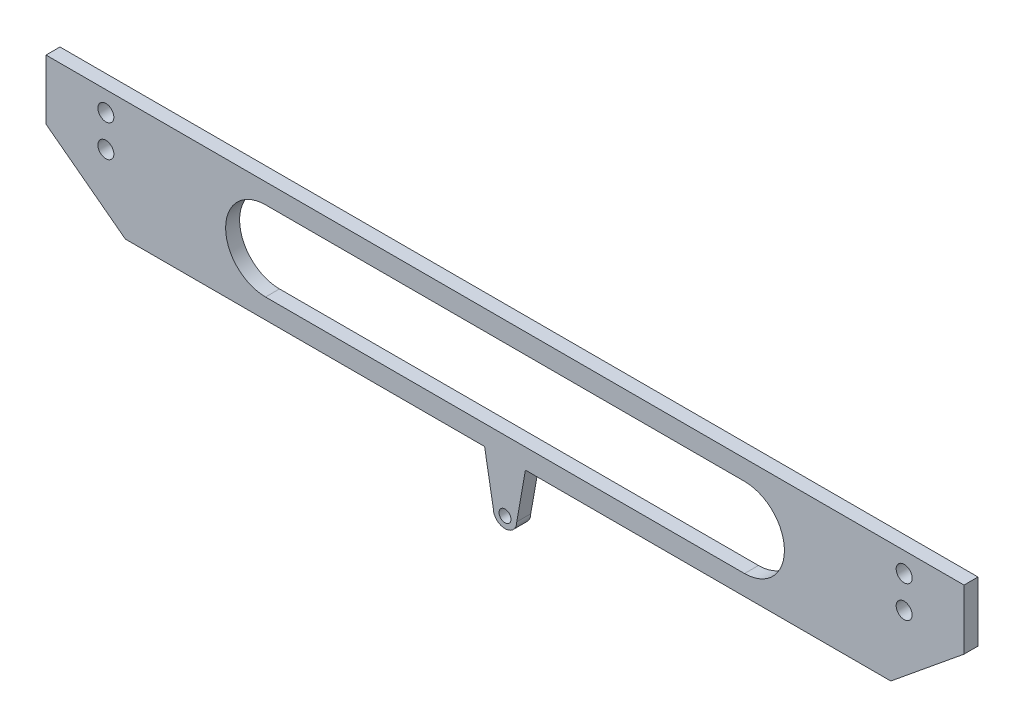
ISO-10303-21;
HEADER;
FILE_DESCRIPTION(('STEP AP214'),'2;1');
FILE_NAME('part.step','',(''),(''),'','','');
FILE_SCHEMA(('AUTOMOTIVE_DESIGN { 1 0 10303 214 1 1 1 1 }'));
ENDSEC;
DATA;
#1=APPLICATION_CONTEXT('core data for automotive mechanical design processes');
#2=APPLICATION_PROTOCOL_DEFINITION('international standard','automotive_design',2000,#1);
#3=PRODUCT_CONTEXT('',#1,'mechanical');
#4=PRODUCT('Part','Part','',(#3));
#5=PRODUCT_RELATED_PRODUCT_CATEGORY('part','',(#4));
#6=PRODUCT_DEFINITION_FORMATION('','',#4);
#7=PRODUCT_DEFINITION_CONTEXT('part definition',#1,'design');
#8=PRODUCT_DEFINITION('design','',#6,#7);
#9=PRODUCT_DEFINITION_SHAPE('','',#8);
#10=(LENGTH_UNIT() NAMED_UNIT(*) SI_UNIT(.MILLI.,.METRE.));
#11=(NAMED_UNIT(*) PLANE_ANGLE_UNIT() SI_UNIT($,.RADIAN.));
#12=(NAMED_UNIT(*) SI_UNIT($,.STERADIAN.) SOLID_ANGLE_UNIT());
#13=UNCERTAINTY_MEASURE_WITH_UNIT(LENGTH_MEASURE(1.E-05),#10,'distance_accuracy_value','');
#14=(GEOMETRIC_REPRESENTATION_CONTEXT(3) GLOBAL_UNCERTAINTY_ASSIGNED_CONTEXT((#13)) GLOBAL_UNIT_ASSIGNED_CONTEXT((#10,
#11,#12)) REPRESENTATION_CONTEXT('',''));
#15=CARTESIAN_POINT('',(0.,0.,0.));
#16=DIRECTION('',(0.,0.,1.));
#17=DIRECTION('',(1.,0.,0.));
#18=AXIS2_PLACEMENT_3D('',#15,#16,#17);
#19=CARTESIAN_POINT('',(-30.1159237685014,77.5000000000003,-3.5));
#20=DIRECTION('',(0.,-1.,0.));
#21=DIRECTION('',(0.,0.,-1.));
#22=AXIS2_PLACEMENT_3D('',#19,#20,#21);
#23=PLANE('',#22);
#24=DIRECTION('',(1.,0.,0.));
#25=VECTOR('',#24,1.);
#26=CARTESIAN_POINT('',(-30.1159237685014,77.5000000000003,0.));
#27=LINE('',#26,#25);
#28=CARTESIAN_POINT('',(-30.1159237685014,77.5000000000003,0.));
#29=VERTEX_POINT('',#28);
#30=CARTESIAN_POINT('',(59.8840762314986,77.5000000000003,0.));
#31=VERTEX_POINT('',#30);
#32=EDGE_CURVE('E178',#29,#31,#27,.T.);
#33=ORIENTED_EDGE('',*,*,#32,.F.);
#34=DIRECTION('',(0.,0.,1.));
#35=VECTOR('',#34,1.);
#36=CARTESIAN_POINT('',(-30.1159237685014,77.5000000000003,-3.5));
#37=LINE('',#36,#35);
#38=CARTESIAN_POINT('',(-30.1159237685014,77.5000000000003,-3.5));
#39=VERTEX_POINT('',#38);
#40=EDGE_CURVE('E11',#39,#29,#37,.T.);
#41=ORIENTED_EDGE('',*,*,#40,.F.);
#42=DIRECTION('',(1.,0.,0.));
#43=VECTOR('',#42,1.);
#44=CARTESIAN_POINT('',(-30.1159237685014,77.5000000000003,-3.5));
#45=LINE('',#44,#43);
#46=CARTESIAN_POINT('',(59.8840762314986,77.5000000000003,-3.5));
#47=VERTEX_POINT('',#46);
#48=EDGE_CURVE('E181',#39,#47,#45,.T.);
#49=ORIENTED_EDGE('',*,*,#48,.T.);
#50=DIRECTION('',(0.,0.,1.));
#51=VECTOR('',#50,1.);
#52=CARTESIAN_POINT('',(59.8840762314986,77.5000000000003,-3.5));
#53=LINE('',#52,#51);
#54=EDGE_CURVE('E37',#47,#31,#53,.T.);
#55=ORIENTED_EDGE('',*,*,#54,.T.);
#56=EDGE_LOOP('',(#33,#41,#49,#55));
#57=FACE_BOUND('',#56,.T.);
#58=ADVANCED_FACE('F34',(#57),#23,.T.);
#59=CARTESIAN_POINT('',(-30.1159237685014,77.5000000000003,-3.5));
#60=DIRECTION('',(-0.602231675437866,-0.798321369561971,0.));
#61=DIRECTION('',(0.798321369561971,-0.602231675437866,0.));
#62=AXIS2_PLACEMENT_3D('',#59,#60,#61);
#63=PLANE('',#62);
#64=DIRECTION('',(0.798321369561971,-0.602231675437866,0.));
#65=VECTOR('',#64,1.);
#66=CARTESIAN_POINT('',(-30.1159237685014,77.5000000000003,0.));
#67=LINE('',#66,#65);
#68=CARTESIAN_POINT('',(-49.9999999999999,92.5000000000003,0.));
#69=VERTEX_POINT('',#68);
#70=EDGE_CURVE('E185',#69,#29,#67,.T.);
#71=ORIENTED_EDGE('',*,*,#70,.F.);
#72=DIRECTION('',(0.,0.,1.));
#73=VECTOR('',#72,1.);
#74=CARTESIAN_POINT('',(-49.9999999999999,92.5000000000003,-3.5));
#75=LINE('',#74,#73);
#76=CARTESIAN_POINT('',(-49.9999999999999,92.5000000000003,-3.5));
#77=VERTEX_POINT('',#76);
#78=EDGE_CURVE('E42',#77,#69,#75,.T.);
#79=ORIENTED_EDGE('',*,*,#78,.F.);
#80=DIRECTION('',(0.798321369561971,-0.602231675437866,0.));
#81=VECTOR('',#80,1.);
#82=CARTESIAN_POINT('',(-30.1159237685014,77.5000000000003,-3.5));
#83=LINE('',#82,#81);
#84=EDGE_CURVE('E209',#77,#39,#83,.T.);
#85=ORIENTED_EDGE('',*,*,#84,.T.);
#86=ORIENTED_EDGE('',*,*,#40,.T.);
#87=EDGE_LOOP('',(#71,#79,#85,#86));
#88=FACE_BOUND('',#87,.T.);
#89=ADVANCED_FACE('F266',(#88),#63,.T.);
#90=CARTESIAN_POINT('',(-49.9999999999999,92.5000000000003,-3.5));
#91=DIRECTION('',(-1.,0.,0.));
#92=DIRECTION('',(0.,0.,1.));
#93=AXIS2_PLACEMENT_3D('',#90,#91,#92);
#94=PLANE('',#93);
#95=DIRECTION('',(0.,-1.,0.));
#96=VECTOR('',#95,1.);
#97=CARTESIAN_POINT('',(-49.9999999999999,92.5000000000003,0.));
#98=LINE('',#97,#96);
#99=CARTESIAN_POINT('',(-49.9999999999999,107.5,0.));
#100=VERTEX_POINT('',#99);
#101=EDGE_CURVE('E235',#100,#69,#98,.T.);
#102=ORIENTED_EDGE('',*,*,#101,.F.);
#103=DIRECTION('',(0.,0.,1.));
#104=VECTOR('',#103,1.);
#105=CARTESIAN_POINT('',(-49.9999999999999,107.5,-3.5));
#106=LINE('',#105,#104);
#107=CARTESIAN_POINT('',(-49.9999999999999,107.5,-3.5));
#108=VERTEX_POINT('',#107);
#109=EDGE_CURVE('E241',#108,#100,#106,.T.);
#110=ORIENTED_EDGE('',*,*,#109,.F.);
#111=DIRECTION('',(0.,-1.,0.));
#112=VECTOR('',#111,1.);
#113=CARTESIAN_POINT('',(-49.9999999999999,92.5000000000003,-3.5));
#114=LINE('',#113,#112);
#115=EDGE_CURVE('E206',#108,#77,#114,.T.);
#116=ORIENTED_EDGE('',*,*,#115,.T.);
#117=ORIENTED_EDGE('',*,*,#78,.T.);
#118=EDGE_LOOP('',(#102,#110,#116,#117));
#119=FACE_BOUND('',#118,.T.);
#120=ADVANCED_FACE('F294',(#119),#94,.T.);
#121=CARTESIAN_POINT('',(-49.9999999999999,107.5,-3.5));
#122=DIRECTION('',(0.,1.,0.));
#123=DIRECTION('',(0.,0.,1.));
#124=AXIS2_PLACEMENT_3D('',#121,#122,#123);
#125=PLANE('',#124);
#126=DIRECTION('',(-1.,0.,0.));
#127=VECTOR('',#126,1.);
#128=CARTESIAN_POINT('',(-49.9999999999999,107.5,0.));
#129=LINE('',#128,#127);
#130=CARTESIAN_POINT('',(180.,107.5,0.));
#131=VERTEX_POINT('',#130);
#132=EDGE_CURVE('E232',#131,#100,#129,.T.);
#133=ORIENTED_EDGE('',*,*,#132,.F.);
#134=DIRECTION('',(0.,0.,1.));
#135=VECTOR('',#134,1.);
#136=CARTESIAN_POINT('',(180.,107.5,-3.5));
#137=LINE('',#136,#135);
#138=CARTESIAN_POINT('',(180.,107.5,-3.5));
#139=VERTEX_POINT('',#138);
#140=EDGE_CURVE('E243',#139,#131,#137,.T.);
#141=ORIENTED_EDGE('',*,*,#140,.F.);
#142=DIRECTION('',(-1.,0.,0.));
#143=VECTOR('',#142,1.);
#144=CARTESIAN_POINT('',(-49.9999999999999,107.5,-3.5));
#145=LINE('',#144,#143);
#146=EDGE_CURVE('E203',#139,#108,#145,.T.);
#147=ORIENTED_EDGE('',*,*,#146,.T.);
#148=ORIENTED_EDGE('',*,*,#109,.T.);
#149=EDGE_LOOP('',(#133,#141,#147,#148));
#150=FACE_BOUND('',#149,.T.);
#151=ADVANCED_FACE('F292',(#150),#125,.T.);
#152=CARTESIAN_POINT('',(180.,92.5000000000003,-3.5));
#153=DIRECTION('',(1.,0.,0.));
#154=DIRECTION('',(0.,0.,-1.));
#155=AXIS2_PLACEMENT_3D('',#152,#153,#154);
#156=PLANE('',#155);
#157=DIRECTION('',(0.,1.,0.));
#158=VECTOR('',#157,1.);
#159=CARTESIAN_POINT('',(180.,92.5000000000003,0.));
#160=LINE('',#159,#158);
#161=CARTESIAN_POINT('',(180.,92.5000000000003,0.));
#162=VERTEX_POINT('',#161);
#163=EDGE_CURVE('E229',#162,#131,#160,.T.);
#164=ORIENTED_EDGE('',*,*,#163,.F.);
#165=DIRECTION('',(0.,0.,1.));
#166=VECTOR('',#165,1.);
#167=CARTESIAN_POINT('',(180.,92.5000000000003,-3.5));
#168=LINE('',#167,#166);
#169=CARTESIAN_POINT('',(180.,92.5000000000003,-3.5));
#170=VERTEX_POINT('',#169);
#171=EDGE_CURVE('E245',#170,#162,#168,.T.);
#172=ORIENTED_EDGE('',*,*,#171,.F.);
#173=DIRECTION('',(0.,1.,0.));
#174=VECTOR('',#173,1.);
#175=CARTESIAN_POINT('',(180.,92.5000000000003,-3.5));
#176=LINE('',#175,#174);
#177=EDGE_CURVE('E200',#170,#139,#176,.T.);
#178=ORIENTED_EDGE('',*,*,#177,.T.);
#179=ORIENTED_EDGE('',*,*,#140,.T.);
#180=EDGE_LOOP('',(#164,#172,#178,#179));
#181=FACE_BOUND('',#180,.T.);
#182=ADVANCED_FACE('F288',(#181),#156,.T.);
#183=CARTESIAN_POINT('',(161.654067638135,77.5000000000003,-3.5));
#184=DIRECTION('',(0.632977188407132,-0.774170445674725,0.));
#185=DIRECTION('',(0.774170445674725,0.632977188407132,0.));
#186=AXIS2_PLACEMENT_3D('',#183,#184,#185);
#187=PLANE('',#186);
#188=DIRECTION('',(0.774170445674725,0.632977188407132,0.));
#189=VECTOR('',#188,1.);
#190=CARTESIAN_POINT('',(161.654067638135,77.5000000000003,0.));
#191=LINE('',#190,#189);
#192=CARTESIAN_POINT('',(161.654067638135,77.5000000000003,0.));
#193=VERTEX_POINT('',#192);
#194=EDGE_CURVE('E226',#193,#162,#191,.T.);
#195=ORIENTED_EDGE('',*,*,#194,.F.);
#196=DIRECTION('',(0.,0.,1.));
#197=VECTOR('',#196,1.);
#198=CARTESIAN_POINT('',(161.654067638135,77.5000000000003,-3.5));
#199=LINE('',#198,#197);
#200=CARTESIAN_POINT('',(161.654067638135,77.5000000000003,-3.5));
#201=VERTEX_POINT('',#200);
#202=EDGE_CURVE('E247',#201,#193,#199,.T.);
#203=ORIENTED_EDGE('',*,*,#202,.F.);
#204=DIRECTION('',(0.774170445674725,0.632977188407132,0.));
#205=VECTOR('',#204,1.);
#206=CARTESIAN_POINT('',(161.654067638135,77.5000000000003,-3.5));
#207=LINE('',#206,#205);
#208=EDGE_CURVE('E197',#201,#170,#207,.T.);
#209=ORIENTED_EDGE('',*,*,#208,.T.);
#210=ORIENTED_EDGE('',*,*,#171,.T.);
#211=EDGE_LOOP('',(#195,#203,#209,#210));
#212=FACE_BOUND('',#211,.T.);
#213=ADVANCED_FACE('F284',(#212),#187,.T.);
#214=CARTESIAN_POINT('',(161.654067638135,77.5000000000003,-3.5));
#215=DIRECTION('',(0.,-1.,0.));
#216=DIRECTION('',(1.,0.,0.));
#217=AXIS2_PLACEMENT_3D('',#214,#215,#216);
#218=PLANE('',#217);
#219=DIRECTION('',(1.,0.,0.));
#220=VECTOR('',#219,1.);
#221=CARTESIAN_POINT('',(161.654067638135,77.5000000000003,0.));
#222=LINE('',#221,#220);
#223=CARTESIAN_POINT('',(70.1159237685016,77.5000000000003,0.));
#224=VERTEX_POINT('',#223);
#225=EDGE_CURVE('E223',#224,#193,#222,.T.);
#226=ORIENTED_EDGE('',*,*,#225,.F.);
#227=DIRECTION('',(0.,0.,1.));
#228=VECTOR('',#227,1.);
#229=CARTESIAN_POINT('',(70.1159237685016,77.5000000000003,-3.5));
#230=LINE('',#229,#228);
#231=CARTESIAN_POINT('',(70.1159237685016,77.5000000000003,-3.5));
#232=VERTEX_POINT('',#231);
#233=EDGE_CURVE('E249',#232,#224,#230,.T.);
#234=ORIENTED_EDGE('',*,*,#233,.F.);
#235=DIRECTION('',(1.,0.,0.));
#236=VECTOR('',#235,1.);
#237=CARTESIAN_POINT('',(161.654067638135,77.5000000000003,-3.5));
#238=LINE('',#237,#236);
#239=EDGE_CURVE('E194',#232,#201,#238,.T.);
#240=ORIENTED_EDGE('',*,*,#239,.T.);
#241=ORIENTED_EDGE('',*,*,#202,.T.);
#242=EDGE_LOOP('',(#226,#234,#240,#241));
#243=FACE_BOUND('',#242,.T.);
#244=ADVANCED_FACE('F280',(#243),#218,.T.);
#245=CARTESIAN_POINT('',(70.1159237685016,77.5000000000003,-3.5));
#246=DIRECTION('',(0.984807753012209,-0.173648177666928,0.));
#247=DIRECTION('',(0.173648177666928,0.984807753012209,0.));
#248=AXIS2_PLACEMENT_3D('',#245,#246,#247);
#249=PLANE('',#248);
#250=DIRECTION('',(0.173648177666928,0.984807753012208,0.));
#251=VECTOR('',#250,1.);
#252=CARTESIAN_POINT('',(70.1159237685016,77.5000000000003,0.));
#253=LINE('',#252,#251);
#254=CARTESIAN_POINT('',(67.9426881237155,65.174968197979,0.));
#255=VERTEX_POINT('',#254);
#256=EDGE_CURVE('E220',#255,#224,#253,.T.);
#257=ORIENTED_EDGE('',*,*,#256,.F.);
#258=DIRECTION('',(0.,0.,1.));
#259=VECTOR('',#258,1.);
#260=CARTESIAN_POINT('',(67.9426881237155,65.174968197979,-3.5));
#261=LINE('',#260,#259);
#262=CARTESIAN_POINT('',(67.9426881237155,65.174968197979,-3.5));
#263=VERTEX_POINT('',#262);
#264=EDGE_CURVE('E251',#263,#255,#261,.T.);
#265=ORIENTED_EDGE('',*,*,#264,.F.);
#266=DIRECTION('',(0.173648177666928,0.984807753012208,0.));
#267=VECTOR('',#266,1.);
#268=CARTESIAN_POINT('',(70.1159237685016,77.5000000000003,-3.5));
#269=LINE('',#268,#267);
#270=EDGE_CURVE('E191',#263,#232,#269,.T.);
#271=ORIENTED_EDGE('',*,*,#270,.T.);
#272=ORIENTED_EDGE('',*,*,#233,.T.);
#273=EDGE_LOOP('',(#257,#265,#271,#272));
#274=FACE_BOUND('',#273,.T.);
#275=ADVANCED_FACE('F278',(#274),#249,.T.);
#276=CARTESIAN_POINT('',(65.0000000000001,65.174968197979,-3.5));
#277=DIRECTION('',(0.,0.,1.));
#278=DIRECTION('',(1.,0.,0.));
#279=AXIS2_PLACEMENT_3D('',#276,#277,#278);
#280=CYLINDRICAL_SURFACE('',#279,2.94268812371533);
#281=CARTESIAN_POINT('',(65.0000000000001,65.174968197979,0.));
#282=DIRECTION('',(0.,0.,1.));
#283=DIRECTION('',(-1.,0.,0.));
#284=AXIS2_PLACEMENT_3D('',#281,#282,#283);
#285=CIRCLE('',#284,2.94268812371533);
#286=CARTESIAN_POINT('',(62.0573118762848,65.174968197979,0.));
#287=VERTEX_POINT('',#286);
#288=EDGE_CURVE('E217',#287,#255,#285,.T.);
#289=ORIENTED_EDGE('',*,*,#288,.F.);
#290=DIRECTION('',(0.,0.,1.));
#291=VECTOR('',#290,1.);
#292=CARTESIAN_POINT('',(62.0573118762848,65.174968197979,-3.5));
#293=LINE('',#292,#291);
#294=CARTESIAN_POINT('',(62.0573118762848,65.174968197979,-3.5));
#295=VERTEX_POINT('',#294);
#296=EDGE_CURVE('E252',#295,#287,#293,.T.);
#297=ORIENTED_EDGE('',*,*,#296,.F.);
#298=CARTESIAN_POINT('',(65.0000000000001,65.174968197979,-3.5));
#299=DIRECTION('',(0.,0.,1.));
#300=DIRECTION('',(-1.,0.,0.));
#301=AXIS2_PLACEMENT_3D('',#298,#299,#300);
#302=CIRCLE('',#301,2.94268812371533);
#303=EDGE_CURVE('E188',#295,#263,#302,.T.);
#304=ORIENTED_EDGE('',*,*,#303,.T.);
#305=ORIENTED_EDGE('',*,*,#264,.T.);
#306=EDGE_LOOP('',(#289,#297,#304,#305));
#307=FACE_BOUND('',#306,.T.);
#308=ADVANCED_FACE('F274',(#307),#280,.T.);
#309=CARTESIAN_POINT('',(59.8840762314986,77.5000000000003,-3.5));
#310=DIRECTION('',(-0.984807753012209,-0.173648177666928,0.));
#311=DIRECTION('',(0.173648177666928,-0.984807753012209,0.));
#312=AXIS2_PLACEMENT_3D('',#309,#310,#311);
#313=PLANE('',#312);
#314=DIRECTION('',(0.173648177666928,-0.984807753012208,0.));
#315=VECTOR('',#314,1.);
#316=CARTESIAN_POINT('',(59.8840762314986,77.5000000000003,0.));
#317=LINE('',#316,#315);
#318=EDGE_CURVE('E214',#31,#287,#317,.T.);
#319=ORIENTED_EDGE('',*,*,#318,.F.);
#320=ORIENTED_EDGE('',*,*,#54,.F.);
#321=DIRECTION('',(0.173648177666928,-0.984807753012208,0.));
#322=VECTOR('',#321,1.);
#323=CARTESIAN_POINT('',(59.8840762314986,77.5000000000003,-3.5));
#324=LINE('',#323,#322);
#325=EDGE_CURVE('E184',#47,#295,#324,.T.);
#326=ORIENTED_EDGE('',*,*,#325,.T.);
#327=ORIENTED_EDGE('',*,*,#296,.T.);
#328=EDGE_LOOP('',(#319,#320,#326,#327));
#329=FACE_BOUND('',#328,.T.);
#330=ADVANCED_FACE('F260',(#329),#313,.T.);
#331=CARTESIAN_POINT('',(65.0000000000001,65.174968197979,-3.5));
#332=DIRECTION('',(0.,0.,-1.));
#333=DIRECTION('',(-1.,0.,0.));
#334=AXIS2_PLACEMENT_3D('',#331,#332,#333);
#335=PLANE('',#334);
#336=CARTESIAN_POINT('',(165.,102.5,-3.5));
#337=DIRECTION('',(0.,0.,-1.));
#338=DIRECTION('',(-1.,0.,0.));
#339=AXIS2_PLACEMENT_3D('',#336,#337,#338);
#340=CIRCLE('',#339,2.);
#341=CARTESIAN_POINT('',(163.,102.5,-3.5));
#342=VERTEX_POINT('',#341);
#343=EDGE_CURVE('E159',#342,#342,#340,.T.);
#344=ORIENTED_EDGE('',*,*,#343,.F.);
#345=EDGE_LOOP('',(#344));
#346=FACE_BOUND('',#345,.T.);
#347=CARTESIAN_POINT('',(165.,94.5000000000003,-3.5));
#348=DIRECTION('',(0.,0.,-1.));
#349=DIRECTION('',(-1.,0.,0.));
#350=AXIS2_PLACEMENT_3D('',#347,#348,#349);
#351=CIRCLE('',#350,2.);
#352=CARTESIAN_POINT('',(163.,94.5000000000003,-3.5));
#353=VERTEX_POINT('',#352);
#354=EDGE_CURVE('E495',#353,#353,#351,.T.);
#355=ORIENTED_EDGE('',*,*,#354,.F.);
#356=EDGE_LOOP('',(#355));
#357=FACE_BOUND('',#356,.T.);
#358=CARTESIAN_POINT('',(-34.9999999999999,94.5000000000003,-3.5));
#359=DIRECTION('',(0.,0.,-1.));
#360=DIRECTION('',(-1.,0.,0.));
#361=AXIS2_PLACEMENT_3D('',#358,#359,#360);
#362=CIRCLE('',#361,2.);
#363=CARTESIAN_POINT('',(-36.9999999999999,94.5000000000003,-3.5));
#364=VERTEX_POINT('',#363);
#365=EDGE_CURVE('E493',#364,#364,#362,.T.);
#366=ORIENTED_EDGE('',*,*,#365,.F.);
#367=EDGE_LOOP('',(#366));
#368=FACE_BOUND('',#367,.T.);
#369=CARTESIAN_POINT('',(-34.9999999999999,102.5,-3.5));
#370=DIRECTION('',(0.,0.,-1.));
#371=DIRECTION('',(-1.,0.,0.));
#372=AXIS2_PLACEMENT_3D('',#369,#370,#371);
#373=CIRCLE('',#372,2.);
#374=CARTESIAN_POINT('',(-36.9999999999999,102.5,-3.5));
#375=VERTEX_POINT('',#374);
#376=EDGE_CURVE('E490',#375,#375,#373,.T.);
#377=ORIENTED_EDGE('',*,*,#376,.F.);
#378=EDGE_LOOP('',(#377));
#379=FACE_BOUND('',#378,.T.);
#380=CARTESIAN_POINT('',(125.,92.5000000000003,-3.5));
#381=DIRECTION('',(0.,0.,1.));
#382=DIRECTION('',(1.,0.,0.));
#383=AXIS2_PLACEMENT_3D('',#380,#381,#382);
#384=CIRCLE('',#383,10.);
#385=CARTESIAN_POINT('',(125.,82.5000000000003,-3.5));
#386=VERTEX_POINT('',#385);
#387=CARTESIAN_POINT('',(125.,102.5,-3.5));
#388=VERTEX_POINT('',#387);
#389=EDGE_CURVE('E137',#386,#388,#384,.T.);
#390=ORIENTED_EDGE('',*,*,#389,.T.);
#391=DIRECTION('',(-1.,0.,0.));
#392=VECTOR('',#391,1.);
#393=CARTESIAN_POINT('',(125.,102.5,-3.5));
#394=LINE('',#393,#392);
#395=CARTESIAN_POINT('',(5.00000000000014,102.5,-3.5));
#396=VERTEX_POINT('',#395);
#397=EDGE_CURVE('E146',#388,#396,#394,.T.);
#398=ORIENTED_EDGE('',*,*,#397,.T.);
#399=CARTESIAN_POINT('',(5.00000000000014,92.5000000000003,-3.5));
#400=DIRECTION('',(0.,0.,1.));
#401=DIRECTION('',(1.,0.,0.));
#402=AXIS2_PLACEMENT_3D('',#399,#400,#401);
#403=CIRCLE('',#402,10.);
#404=CARTESIAN_POINT('',(5.00000000000014,82.5000000000003,-3.5));
#405=VERTEX_POINT('',#404);
#406=EDGE_CURVE('E50',#396,#405,#403,.T.);
#407=ORIENTED_EDGE('',*,*,#406,.T.);
#408=DIRECTION('',(1.,0.,0.));
#409=VECTOR('',#408,1.);
#410=CARTESIAN_POINT('',(125.,82.5000000000003,-3.5));
#411=LINE('',#410,#409);
#412=EDGE_CURVE('E143',#405,#386,#411,.T.);
#413=ORIENTED_EDGE('',*,*,#412,.T.);
#414=EDGE_LOOP('',(#390,#398,#407,#413));
#415=FACE_BOUND('',#414,.T.);
#416=CARTESIAN_POINT('',(65.0000000000001,65.0000000000003,-3.5));
#417=DIRECTION('',(0.,0.,1.));
#418=DIRECTION('',(1.,0.,0.));
#419=AXIS2_PLACEMENT_3D('',#416,#417,#418);
#420=CIRCLE('',#419,1.5);
#421=CARTESIAN_POINT('',(66.5000000000001,65.0000000000003,-3.5));
#422=VERTEX_POINT('',#421);
#423=EDGE_CURVE('E175',#422,#422,#420,.T.);
#424=ORIENTED_EDGE('',*,*,#423,.T.);
#425=EDGE_LOOP('',(#424));
#426=FACE_BOUND('',#425,.T.);
#427=ORIENTED_EDGE('',*,*,#48,.F.);
#428=ORIENTED_EDGE('',*,*,#84,.F.);
#429=ORIENTED_EDGE('',*,*,#115,.F.);
#430=ORIENTED_EDGE('',*,*,#146,.F.);
#431=ORIENTED_EDGE('',*,*,#177,.F.);
#432=ORIENTED_EDGE('',*,*,#208,.F.);
#433=ORIENTED_EDGE('',*,*,#239,.F.);
#434=ORIENTED_EDGE('',*,*,#270,.F.);
#435=ORIENTED_EDGE('',*,*,#303,.F.);
#436=ORIENTED_EDGE('',*,*,#325,.F.);
#437=EDGE_LOOP('',(#427,#428,#429,#430,#431,#432,#433,#434,#435,#436));
#438=FACE_BOUND('',#437,.T.);
#439=ADVANCED_FACE('F150',(#346,#357,#368,#379,#415,#426,#438),#335,.T.);
#440=CARTESIAN_POINT('',(65.0000000000001,65.174968197979,0.));
#441=DIRECTION('',(0.,0.,-1.));
#442=DIRECTION('',(-1.,0.,0.));
#443=AXIS2_PLACEMENT_3D('',#440,#441,#442);
#444=PLANE('',#443);
#445=CARTESIAN_POINT('',(165.,102.5,0.));
#446=DIRECTION('',(0.,0.,1.));
#447=DIRECTION('',(-1.,0.,0.));
#448=AXIS2_PLACEMENT_3D('',#445,#446,#447);
#449=CIRCLE('',#448,2.);
#450=CARTESIAN_POINT('',(163.,102.5,0.));
#451=VERTEX_POINT('',#450);
#452=EDGE_CURVE('E479',#451,#451,#449,.T.);
#453=ORIENTED_EDGE('',*,*,#452,.F.);
#454=EDGE_LOOP('',(#453));
#455=FACE_BOUND('',#454,.T.);
#456=CARTESIAN_POINT('',(165.,94.5000000000003,0.));
#457=DIRECTION('',(0.,0.,1.));
#458=DIRECTION('',(-1.,0.,0.));
#459=AXIS2_PLACEMENT_3D('',#456,#457,#458);
#460=CIRCLE('',#459,2.);
#461=CARTESIAN_POINT('',(163.,94.5000000000003,0.));
#462=VERTEX_POINT('',#461);
#463=EDGE_CURVE('E480',#462,#462,#460,.T.);
#464=ORIENTED_EDGE('',*,*,#463,.F.);
#465=EDGE_LOOP('',(#464));
#466=FACE_BOUND('',#465,.T.);
#467=CARTESIAN_POINT('',(-34.9999999999999,94.5000000000003,0.));
#468=DIRECTION('',(0.,0.,1.));
#469=DIRECTION('',(1.,0.,0.));
#470=AXIS2_PLACEMENT_3D('',#467,#468,#469);
#471=CIRCLE('',#470,2.);
#472=CARTESIAN_POINT('',(-32.9999999999999,94.5000000000003,0.));
#473=VERTEX_POINT('',#472);
#474=EDGE_CURVE('E483',#473,#473,#471,.T.);
#475=ORIENTED_EDGE('',*,*,#474,.F.);
#476=EDGE_LOOP('',(#475));
#477=FACE_BOUND('',#476,.T.);
#478=CARTESIAN_POINT('',(-34.9999999999999,102.5,0.));
#479=DIRECTION('',(0.,0.,1.));
#480=DIRECTION('',(1.,0.,0.));
#481=AXIS2_PLACEMENT_3D('',#478,#479,#480);
#482=CIRCLE('',#481,2.);
#483=CARTESIAN_POINT('',(-32.9999999999999,102.5,0.));
#484=VERTEX_POINT('',#483);
#485=EDGE_CURVE('E487',#484,#484,#482,.T.);
#486=ORIENTED_EDGE('',*,*,#485,.F.);
#487=EDGE_LOOP('',(#486));
#488=FACE_BOUND('',#487,.T.);
#489=DIRECTION('',(-1.,0.,0.));
#490=VECTOR('',#489,1.);
#491=CARTESIAN_POINT('',(125.,102.5,0.));
#492=LINE('',#491,#490);
#493=CARTESIAN_POINT('',(125.,102.5,0.));
#494=VERTEX_POINT('',#493);
#495=CARTESIAN_POINT('',(5.00000000000013,102.5,0.));
#496=VERTEX_POINT('',#495);
#497=EDGE_CURVE('E165',#494,#496,#492,.T.);
#498=ORIENTED_EDGE('',*,*,#497,.F.);
#499=CARTESIAN_POINT('',(125.,92.5000000000003,0.));
#500=DIRECTION('',(0.,0.,1.));
#501=DIRECTION('',(1.,0.,0.));
#502=AXIS2_PLACEMENT_3D('',#499,#500,#501);
#503=CIRCLE('',#502,10.);
#504=CARTESIAN_POINT('',(125.,82.5000000000003,0.));
#505=VERTEX_POINT('',#504);
#506=EDGE_CURVE('E58',#505,#494,#503,.T.);
#507=ORIENTED_EDGE('',*,*,#506,.F.);
#508=DIRECTION('',(1.,0.,0.));
#509=VECTOR('',#508,1.);
#510=CARTESIAN_POINT('',(125.,82.5000000000003,0.));
#511=LINE('',#510,#509);
#512=CARTESIAN_POINT('',(5.00000000000014,82.5000000000003,0.));
#513=VERTEX_POINT('',#512);
#514=EDGE_CURVE('E153',#513,#505,#511,.T.);
#515=ORIENTED_EDGE('',*,*,#514,.F.);
#516=CARTESIAN_POINT('',(5.00000000000014,92.5000000000003,0.));
#517=DIRECTION('',(0.,0.,1.));
#518=DIRECTION('',(1.,0.,0.));
#519=AXIS2_PLACEMENT_3D('',#516,#517,#518);
#520=CIRCLE('',#519,10.);
#521=EDGE_CURVE('E156',#496,#513,#520,.T.);
#522=ORIENTED_EDGE('',*,*,#521,.F.);
#523=EDGE_LOOP('',(#498,#507,#515,#522));
#524=FACE_BOUND('',#523,.T.);
#525=CARTESIAN_POINT('',(65.0000000000001,65.0000000000003,0.));
#526=DIRECTION('',(0.,0.,1.));
#527=DIRECTION('',(1.,0.,0.));
#528=AXIS2_PLACEMENT_3D('',#525,#526,#527);
#529=CIRCLE('',#528,1.5);
#530=CARTESIAN_POINT('',(66.5000000000001,65.0000000000003,0.));
#531=VERTEX_POINT('',#530);
#532=EDGE_CURVE('E171',#531,#531,#529,.T.);
#533=ORIENTED_EDGE('',*,*,#532,.F.);
#534=EDGE_LOOP('',(#533));
#535=FACE_BOUND('',#534,.T.);
#536=ORIENTED_EDGE('',*,*,#32,.T.);
#537=ORIENTED_EDGE('',*,*,#318,.T.);
#538=ORIENTED_EDGE('',*,*,#288,.T.);
#539=ORIENTED_EDGE('',*,*,#256,.T.);
#540=ORIENTED_EDGE('',*,*,#225,.T.);
#541=ORIENTED_EDGE('',*,*,#194,.T.);
#542=ORIENTED_EDGE('',*,*,#163,.T.);
#543=ORIENTED_EDGE('',*,*,#132,.T.);
#544=ORIENTED_EDGE('',*,*,#101,.T.);
#545=ORIENTED_EDGE('',*,*,#70,.T.);
#546=EDGE_LOOP('',(#536,#537,#538,#539,#540,#541,#542,#543,#544,#545));
#547=FACE_BOUND('',#546,.T.);
#548=ADVANCED_FACE('F262',(#455,#466,#477,#488,#524,#535,#547),#444,.F.);
#549=CARTESIAN_POINT('',(65.0000000000001,65.0000000000003,-3.5));
#550=DIRECTION('',(0.,0.,1.));
#551=DIRECTION('',(1.,0.,0.));
#552=AXIS2_PLACEMENT_3D('',#549,#550,#551);
#553=CYLINDRICAL_SURFACE('',#552,1.5);
#554=ORIENTED_EDGE('',*,*,#423,.F.);
#555=EDGE_LOOP('',(#554));
#556=FACE_BOUND('',#555,.T.);
#557=ORIENTED_EDGE('',*,*,#532,.T.);
#558=EDGE_LOOP('',(#557));
#559=FACE_BOUND('',#558,.T.);
#560=ADVANCED_FACE('F374',(#556,#559),#553,.F.);
#561=CARTESIAN_POINT('',(125.,92.5000000000003,-3.5));
#562=DIRECTION('',(0.,0.,1.));
#563=DIRECTION('',(1.,0.,0.));
#564=AXIS2_PLACEMENT_3D('',#561,#562,#563);
#565=CYLINDRICAL_SURFACE('',#564,10.);
#566=ORIENTED_EDGE('',*,*,#506,.T.);
#567=DIRECTION('',(0.,0.,1.));
#568=VECTOR('',#567,1.);
#569=CARTESIAN_POINT('',(125.,102.5,-3.5));
#570=LINE('',#569,#568);
#571=EDGE_CURVE('E133',#388,#494,#570,.T.);
#572=ORIENTED_EDGE('',*,*,#571,.F.);
#573=ORIENTED_EDGE('',*,*,#389,.F.);
#574=DIRECTION('',(0.,0.,1.));
#575=VECTOR('',#574,1.);
#576=CARTESIAN_POINT('',(125.,82.5000000000003,-3.5));
#577=LINE('',#576,#575);
#578=EDGE_CURVE('E169',#386,#505,#577,.T.);
#579=ORIENTED_EDGE('',*,*,#578,.T.);
#580=EDGE_LOOP('',(#566,#572,#573,#579));
#581=FACE_BOUND('',#580,.T.);
#582=ADVANCED_FACE('F135',(#581),#565,.F.);
#583=CARTESIAN_POINT('',(125.,82.5000000000003,-3.5));
#584=DIRECTION('',(0.,-1.,0.));
#585=DIRECTION('',(0.,0.,-1.));
#586=AXIS2_PLACEMENT_3D('',#583,#584,#585);
#587=PLANE('',#586);
#588=ORIENTED_EDGE('',*,*,#514,.T.);
#589=ORIENTED_EDGE('',*,*,#578,.F.);
#590=ORIENTED_EDGE('',*,*,#412,.F.);
#591=DIRECTION('',(0.,0.,1.));
#592=VECTOR('',#591,1.);
#593=CARTESIAN_POINT('',(5.00000000000014,82.5000000000003,-3.5));
#594=LINE('',#593,#592);
#595=EDGE_CURVE('E172',#405,#513,#594,.T.);
#596=ORIENTED_EDGE('',*,*,#595,.T.);
#597=EDGE_LOOP('',(#588,#589,#590,#596));
#598=FACE_BOUND('',#597,.T.);
#599=ADVANCED_FACE('F390',(#598),#587,.F.);
#600=CARTESIAN_POINT('',(5.00000000000014,92.5000000000003,-3.5));
#601=DIRECTION('',(0.,0.,1.));
#602=DIRECTION('',(1.,0.,0.));
#603=AXIS2_PLACEMENT_3D('',#600,#601,#602);
#604=CYLINDRICAL_SURFACE('',#603,10.);
#605=ORIENTED_EDGE('',*,*,#521,.T.);
#606=ORIENTED_EDGE('',*,*,#595,.F.);
#607=ORIENTED_EDGE('',*,*,#406,.F.);
#608=DIRECTION('',(0.,0.,1.));
#609=VECTOR('',#608,1.);
#610=CARTESIAN_POINT('',(5.00000000000013,102.5,-3.5));
#611=LINE('',#610,#609);
#612=EDGE_CURVE('E142',#396,#496,#611,.T.);
#613=ORIENTED_EDGE('',*,*,#612,.T.);
#614=EDGE_LOOP('',(#605,#606,#607,#613));
#615=FACE_BOUND('',#614,.T.);
#616=ADVANCED_FACE('F399',(#615),#604,.F.);
#617=CARTESIAN_POINT('',(125.,102.5,-3.5));
#618=DIRECTION('',(0.,1.,0.));
#619=DIRECTION('',(-1.,0.,0.));
#620=AXIS2_PLACEMENT_3D('',#617,#618,#619);
#621=PLANE('',#620);
#622=ORIENTED_EDGE('',*,*,#497,.T.);
#623=ORIENTED_EDGE('',*,*,#612,.F.);
#624=ORIENTED_EDGE('',*,*,#397,.F.);
#625=ORIENTED_EDGE('',*,*,#571,.T.);
#626=EDGE_LOOP('',(#622,#623,#624,#625));
#627=FACE_BOUND('',#626,.T.);
#628=ADVANCED_FACE('F147',(#627),#621,.F.);
#629=CARTESIAN_POINT('',(-34.9999999999999,102.5,-10.));
#630=DIRECTION('',(0.,0.,1.));
#631=DIRECTION('',(1.,0.,0.));
#632=AXIS2_PLACEMENT_3D('',#629,#630,#631);
#633=CYLINDRICAL_SURFACE('',#632,2.);
#634=ORIENTED_EDGE('',*,*,#376,.T.);
#635=EDGE_LOOP('',(#634));
#636=FACE_BOUND('',#635,.T.);
#637=ORIENTED_EDGE('',*,*,#485,.T.);
#638=EDGE_LOOP('',(#637));
#639=FACE_BOUND('',#638,.T.);
#640=ADVANCED_FACE('F417',(#636,#639),#633,.F.);
#641=CARTESIAN_POINT('',(-34.9999999999999,94.5000000000003,-10.));
#642=DIRECTION('',(0.,0.,1.));
#643=DIRECTION('',(1.,0.,0.));
#644=AXIS2_PLACEMENT_3D('',#641,#642,#643);
#645=CYLINDRICAL_SURFACE('',#644,2.);
#646=ORIENTED_EDGE('',*,*,#365,.T.);
#647=EDGE_LOOP('',(#646));
#648=FACE_BOUND('',#647,.T.);
#649=ORIENTED_EDGE('',*,*,#474,.T.);
#650=EDGE_LOOP('',(#649));
#651=FACE_BOUND('',#650,.T.);
#652=ADVANCED_FACE('F440',(#648,#651),#645,.F.);
#653=CARTESIAN_POINT('',(165.,94.5000000000003,-10.));
#654=DIRECTION('',(0.,0.,1.));
#655=DIRECTION('',(1.,0.,0.));
#656=AXIS2_PLACEMENT_3D('',#653,#654,#655);
#657=CYLINDRICAL_SURFACE('',#656,2.);
#658=ORIENTED_EDGE('',*,*,#354,.T.);
#659=EDGE_LOOP('',(#658));
#660=FACE_BOUND('',#659,.T.);
#661=ORIENTED_EDGE('',*,*,#463,.T.);
#662=EDGE_LOOP('',(#661));
#663=FACE_BOUND('',#662,.T.);
#664=ADVANCED_FACE('F450',(#660,#663),#657,.F.);
#665=CARTESIAN_POINT('',(165.,102.5,-10.));
#666=DIRECTION('',(0.,0.,1.));
#667=DIRECTION('',(1.,0.,0.));
#668=AXIS2_PLACEMENT_3D('',#665,#666,#667);
#669=CYLINDRICAL_SURFACE('',#668,2.);
#670=ORIENTED_EDGE('',*,*,#343,.T.);
#671=EDGE_LOOP('',(#670));
#672=FACE_BOUND('',#671,.T.);
#673=ORIENTED_EDGE('',*,*,#452,.T.);
#674=EDGE_LOOP('',(#673));
#675=FACE_BOUND('',#674,.T.);
#676=ADVANCED_FACE('F460',(#672,#675),#669,.F.);
#677=CLOSED_SHELL('',(#58,#89,#120,#151,#182,#213,#244,#275,#308,#330,#439,#548,#560,#582,#599,
#616,#628,#640,#652,#664,#676));
#678=MANIFOLD_SOLID_BREP('B2',#677);
#679=ADVANCED_BREP_SHAPE_REPRESENTATION('',(#18,#678),#14);
#680=SHAPE_DEFINITION_REPRESENTATION(#9,#679);
ENDSEC;
END-ISO-10303-21;
